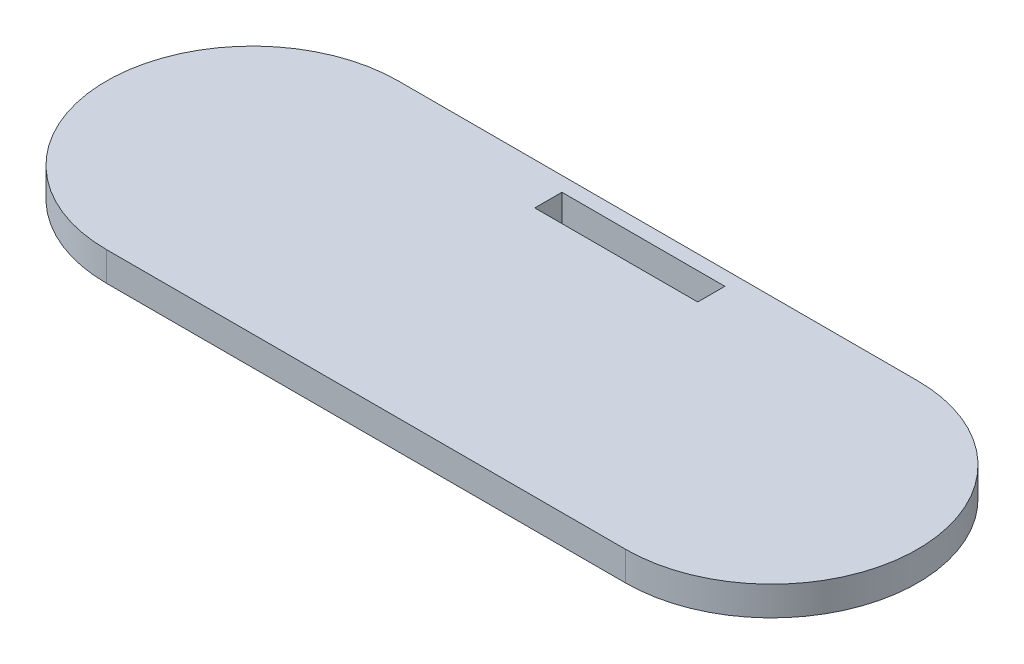
ISO-10303-21;
HEADER;
FILE_DESCRIPTION(('STEP AP214'),'2;1');
FILE_NAME('part.step','',(''),(''),'','','');
FILE_SCHEMA(('AUTOMOTIVE_DESIGN { 1 0 10303 214 1 1 1 1 }'));
ENDSEC;
DATA;
#1=APPLICATION_CONTEXT('core data for automotive mechanical design processes');
#2=APPLICATION_PROTOCOL_DEFINITION('international standard','automotive_design',2000,#1);
#3=PRODUCT_CONTEXT('',#1,'mechanical');
#4=PRODUCT('Part','Part','',(#3));
#5=PRODUCT_RELATED_PRODUCT_CATEGORY('part','',(#4));
#6=PRODUCT_DEFINITION_FORMATION('','',#4);
#7=PRODUCT_DEFINITION_CONTEXT('part definition',#1,'design');
#8=PRODUCT_DEFINITION('design','',#6,#7);
#9=PRODUCT_DEFINITION_SHAPE('','',#8);
#10=(LENGTH_UNIT() NAMED_UNIT(*) SI_UNIT(.MILLI.,.METRE.));
#11=(NAMED_UNIT(*) PLANE_ANGLE_UNIT() SI_UNIT($,.RADIAN.));
#12=(NAMED_UNIT(*) SI_UNIT($,.STERADIAN.) SOLID_ANGLE_UNIT());
#13=UNCERTAINTY_MEASURE_WITH_UNIT(LENGTH_MEASURE(1.E-05),#10,'distance_accuracy_value','');
#14=(GEOMETRIC_REPRESENTATION_CONTEXT(3) GLOBAL_UNCERTAINTY_ASSIGNED_CONTEXT((#13)) GLOBAL_UNIT_ASSIGNED_CONTEXT((#10,
#11,#12)) REPRESENTATION_CONTEXT('',''));
#15=CARTESIAN_POINT('',(0.,0.,0.));
#16=DIRECTION('',(0.,0.,1.));
#17=DIRECTION('',(1.,0.,0.));
#18=AXIS2_PLACEMENT_3D('',#15,#16,#17);
#19=CARTESIAN_POINT('',(0.,10.,0.));
#20=DIRECTION('',(0.,1.,0.));
#21=DIRECTION('',(0.,0.,1.));
#22=AXIS2_PLACEMENT_3D('',#19,#20,#21);
#23=PLANE('',#22);
#24=CARTESIAN_POINT('',(0.,10.,0.));
#25=DIRECTION('',(0.,1.,0.));
#26=DIRECTION('',(0.,0.,1.));
#27=AXIS2_PLACEMENT_3D('',#24,#25,#26);
#28=CIRCLE('',#27,50.);
#29=CARTESIAN_POINT('',(0.,10.,-50.));
#30=VERTEX_POINT('',#29);
#31=CARTESIAN_POINT('',(0.,10.,50.));
#32=VERTEX_POINT('',#31);
#33=EDGE_CURVE('E161',#30,#32,#28,.T.);
#34=ORIENTED_EDGE('',*,*,#33,.T.);
#35=DIRECTION('',(1.,0.,0.));
#36=VECTOR('',#35,1.);
#37=CARTESIAN_POINT('',(0.,10.,50.));
#38=LINE('',#37,#36);
#39=CARTESIAN_POINT('',(177.8,10.,50.));
#40=VERTEX_POINT('',#39);
#41=EDGE_CURVE('E165',#32,#40,#38,.T.);
#42=ORIENTED_EDGE('',*,*,#41,.T.);
#43=CARTESIAN_POINT('',(177.8,10.,0.));
#44=DIRECTION('',(0.,1.,0.));
#45=DIRECTION('',(0.,0.,1.));
#46=AXIS2_PLACEMENT_3D('',#43,#44,#45);
#47=CIRCLE('',#46,50.);
#48=CARTESIAN_POINT('',(177.8,10.,-50.));
#49=VERTEX_POINT('',#48);
#50=EDGE_CURVE('E169',#40,#49,#47,.T.);
#51=ORIENTED_EDGE('',*,*,#50,.T.);
#52=DIRECTION('',(-1.,0.,0.));
#53=VECTOR('',#52,1.);
#54=CARTESIAN_POINT('',(0.,10.,-50.));
#55=LINE('',#54,#53);
#56=EDGE_CURVE('E172',#49,#30,#55,.T.);
#57=ORIENTED_EDGE('',*,*,#56,.T.);
#58=EDGE_LOOP('',(#34,#42,#51,#57));
#59=FACE_BOUND('',#58,.T.);
#60=DIRECTION('',(1.,0.,0.));
#61=VECTOR('',#60,1.);
#62=CARTESIAN_POINT('',(61.,10.,-35.7));
#63=LINE('',#62,#61);
#64=CARTESIAN_POINT('',(61.,10.,-35.7));
#65=VERTEX_POINT('',#64);
#66=CARTESIAN_POINT('',(116.8,10.,-35.7));
#67=VERTEX_POINT('',#66);
#68=EDGE_CURVE('E120',#65,#67,#63,.T.);
#69=ORIENTED_EDGE('',*,*,#68,.F.);
#70=DIRECTION('',(0.,0.,1.));
#71=VECTOR('',#70,1.);
#72=CARTESIAN_POINT('',(61.,10.,-45.));
#73=LINE('',#72,#71);
#74=CARTESIAN_POINT('',(61.,10.,-45.));
#75=VERTEX_POINT('',#74);
#76=EDGE_CURVE('E111',#75,#65,#73,.T.);
#77=ORIENTED_EDGE('',*,*,#76,.F.);
#78=DIRECTION('',(-1.,0.,0.));
#79=VECTOR('',#78,1.);
#80=CARTESIAN_POINT('',(61.,10.,-45.));
#81=LINE('',#80,#79);
#82=CARTESIAN_POINT('',(116.8,10.,-45.));
#83=VERTEX_POINT('',#82);
#84=EDGE_CURVE('E139',#83,#75,#81,.T.);
#85=ORIENTED_EDGE('',*,*,#84,.F.);
#86=DIRECTION('',(0.,0.,-1.));
#87=VECTOR('',#86,1.);
#88=CARTESIAN_POINT('',(116.8,10.,-45.));
#89=LINE('',#88,#87);
#90=EDGE_CURVE('E133',#67,#83,#89,.T.);
#91=ORIENTED_EDGE('',*,*,#90,.F.);
#92=EDGE_LOOP('',(#69,#77,#85,#91));
#93=FACE_BOUND('',#92,.T.);
#94=ADVANCED_FACE('F45',(#59,#93),#23,.T.);
#95=CARTESIAN_POINT('',(0.,0.,0.));
#96=DIRECTION('',(0.,1.,0.));
#97=DIRECTION('',(0.,0.,1.));
#98=AXIS2_PLACEMENT_3D('',#95,#96,#97);
#99=PLANE('',#98);
#100=CARTESIAN_POINT('',(0.,0.,0.));
#101=DIRECTION('',(0.,1.,0.));
#102=DIRECTION('',(0.,0.,1.));
#103=AXIS2_PLACEMENT_3D('',#100,#101,#102);
#104=CIRCLE('',#103,50.);
#105=CARTESIAN_POINT('',(0.,0.,-50.));
#106=VERTEX_POINT('',#105);
#107=CARTESIAN_POINT('',(0.,0.,50.));
#108=VERTEX_POINT('',#107);
#109=EDGE_CURVE('E129',#106,#108,#104,.T.);
#110=ORIENTED_EDGE('',*,*,#109,.F.);
#111=DIRECTION('',(-1.,0.,0.));
#112=VECTOR('',#111,1.);
#113=CARTESIAN_POINT('',(0.,0.,-50.));
#114=LINE('',#113,#112);
#115=CARTESIAN_POINT('',(177.8,0.,-50.));
#116=VERTEX_POINT('',#115);
#117=EDGE_CURVE('E166',#116,#106,#114,.T.);
#118=ORIENTED_EDGE('',*,*,#117,.F.);
#119=CARTESIAN_POINT('',(177.8,0.,0.));
#120=DIRECTION('',(0.,1.,0.));
#121=DIRECTION('',(0.,0.,1.));
#122=AXIS2_PLACEMENT_3D('',#119,#120,#121);
#123=CIRCLE('',#122,50.);
#124=CARTESIAN_POINT('',(177.8,0.,50.));
#125=VERTEX_POINT('',#124);
#126=EDGE_CURVE('E182',#125,#116,#123,.T.);
#127=ORIENTED_EDGE('',*,*,#126,.F.);
#128=DIRECTION('',(1.,0.,0.));
#129=VECTOR('',#128,1.);
#130=CARTESIAN_POINT('',(0.,0.,50.));
#131=LINE('',#130,#129);
#132=EDGE_CURVE('E179',#108,#125,#131,.T.);
#133=ORIENTED_EDGE('',*,*,#132,.F.);
#134=EDGE_LOOP('',(#110,#118,#127,#133));
#135=FACE_BOUND('',#134,.T.);
#136=DIRECTION('',(0.,0.,1.));
#137=VECTOR('',#136,1.);
#138=CARTESIAN_POINT('',(61.,0.,-45.));
#139=LINE('',#138,#137);
#140=CARTESIAN_POINT('',(61.,0.,-45.));
#141=VERTEX_POINT('',#140);
#142=CARTESIAN_POINT('',(61.,0.,-35.7));
#143=VERTEX_POINT('',#142);
#144=EDGE_CURVE('E69',#141,#143,#139,.T.);
#145=ORIENTED_EDGE('',*,*,#144,.T.);
#146=DIRECTION('',(1.,0.,0.));
#147=VECTOR('',#146,1.);
#148=CARTESIAN_POINT('',(61.,0.,-35.7));
#149=LINE('',#148,#147);
#150=CARTESIAN_POINT('',(116.8,0.,-35.7));
#151=VERTEX_POINT('',#150);
#152=EDGE_CURVE('E127',#143,#151,#149,.T.);
#153=ORIENTED_EDGE('',*,*,#152,.T.);
#154=DIRECTION('',(0.,0.,-1.));
#155=VECTOR('',#154,1.);
#156=CARTESIAN_POINT('',(116.8,0.,-45.));
#157=LINE('',#156,#155);
#158=CARTESIAN_POINT('',(116.8,0.,-45.));
#159=VERTEX_POINT('',#158);
#160=EDGE_CURVE('E148',#151,#159,#157,.T.);
#161=ORIENTED_EDGE('',*,*,#160,.T.);
#162=DIRECTION('',(-1.,0.,0.));
#163=VECTOR('',#162,1.);
#164=CARTESIAN_POINT('',(61.,0.,-45.));
#165=LINE('',#164,#163);
#166=EDGE_CURVE('E121',#159,#141,#165,.T.);
#167=ORIENTED_EDGE('',*,*,#166,.T.);
#168=EDGE_LOOP('',(#145,#153,#161,#167));
#169=FACE_BOUND('',#168,.T.);
#170=ADVANCED_FACE('F207',(#135,#169),#99,.F.);
#171=CARTESIAN_POINT('',(0.,10.,0.));
#172=DIRECTION('',(0.,-1.,0.));
#173=DIRECTION('',(0.,0.,-1.));
#174=AXIS2_PLACEMENT_3D('',#171,#172,#173);
#175=CYLINDRICAL_SURFACE('',#174,50.);
#176=ORIENTED_EDGE('',*,*,#109,.T.);
#177=DIRECTION('',(0.,-1.,0.));
#178=VECTOR('',#177,1.);
#179=CARTESIAN_POINT('',(0.,10.,50.));
#180=LINE('',#179,#178);
#181=EDGE_CURVE('E11',#32,#108,#180,.T.);
#182=ORIENTED_EDGE('',*,*,#181,.F.);
#183=ORIENTED_EDGE('',*,*,#33,.F.);
#184=DIRECTION('',(0.,-1.,0.));
#185=VECTOR('',#184,1.);
#186=CARTESIAN_POINT('',(0.,10.,-50.));
#187=LINE('',#186,#185);
#188=EDGE_CURVE('E175',#30,#106,#187,.T.);
#189=ORIENTED_EDGE('',*,*,#188,.T.);
#190=EDGE_LOOP('',(#176,#182,#183,#189));
#191=FACE_BOUND('',#190,.T.);
#192=ADVANCED_FACE('F47',(#191),#175,.T.);
#193=CARTESIAN_POINT('',(0.,10.,50.));
#194=DIRECTION('',(0.,0.,-1.));
#195=DIRECTION('',(-1.,0.,0.));
#196=AXIS2_PLACEMENT_3D('',#193,#194,#195);
#197=PLANE('',#196);
#198=ORIENTED_EDGE('',*,*,#132,.T.);
#199=DIRECTION('',(0.,-1.,0.));
#200=VECTOR('',#199,1.);
#201=CARTESIAN_POINT('',(177.8,10.,50.));
#202=LINE('',#201,#200);
#203=EDGE_CURVE('E54',#40,#125,#202,.T.);
#204=ORIENTED_EDGE('',*,*,#203,.F.);
#205=ORIENTED_EDGE('',*,*,#41,.F.);
#206=ORIENTED_EDGE('',*,*,#181,.T.);
#207=EDGE_LOOP('',(#198,#204,#205,#206));
#208=FACE_BOUND('',#207,.T.);
#209=ADVANCED_FACE('F217',(#208),#197,.F.);
#210=CARTESIAN_POINT('',(177.8,10.,0.));
#211=DIRECTION('',(0.,-1.,0.));
#212=DIRECTION('',(0.,0.,-1.));
#213=AXIS2_PLACEMENT_3D('',#210,#211,#212);
#214=CYLINDRICAL_SURFACE('',#213,50.);
#215=ORIENTED_EDGE('',*,*,#126,.T.);
#216=DIRECTION('',(0.,-1.,0.));
#217=VECTOR('',#216,1.);
#218=CARTESIAN_POINT('',(177.8,10.,-50.));
#219=LINE('',#218,#217);
#220=EDGE_CURVE('E190',#49,#116,#219,.T.);
#221=ORIENTED_EDGE('',*,*,#220,.F.);
#222=ORIENTED_EDGE('',*,*,#50,.F.);
#223=ORIENTED_EDGE('',*,*,#203,.T.);
#224=EDGE_LOOP('',(#215,#221,#222,#223));
#225=FACE_BOUND('',#224,.T.);
#226=ADVANCED_FACE('F201',(#225),#214,.T.);
#227=CARTESIAN_POINT('',(0.,10.,-50.));
#228=DIRECTION('',(0.,0.,1.));
#229=DIRECTION('',(1.,0.,0.));
#230=AXIS2_PLACEMENT_3D('',#227,#228,#229);
#231=PLANE('',#230);
#232=ORIENTED_EDGE('',*,*,#117,.T.);
#233=ORIENTED_EDGE('',*,*,#188,.F.);
#234=ORIENTED_EDGE('',*,*,#56,.F.);
#235=ORIENTED_EDGE('',*,*,#220,.T.);
#236=EDGE_LOOP('',(#232,#233,#234,#235));
#237=FACE_BOUND('',#236,.T.);
#238=ADVANCED_FACE('F211',(#237),#231,.F.);
#239=CARTESIAN_POINT('',(61.,10.,-45.));
#240=DIRECTION('',(1.,0.,0.));
#241=DIRECTION('',(0.,0.,-1.));
#242=AXIS2_PLACEMENT_3D('',#239,#240,#241);
#243=PLANE('',#242);
#244=ORIENTED_EDGE('',*,*,#144,.F.);
#245=DIRECTION('',(0.,-1.,0.));
#246=VECTOR('',#245,1.);
#247=CARTESIAN_POINT('',(61.,10.,-45.));
#248=LINE('',#247,#246);
#249=EDGE_CURVE('E115',#75,#141,#248,.T.);
#250=ORIENTED_EDGE('',*,*,#249,.F.);
#251=ORIENTED_EDGE('',*,*,#76,.T.);
#252=DIRECTION('',(0.,-1.,0.));
#253=VECTOR('',#252,1.);
#254=CARTESIAN_POINT('',(61.,10.,-35.7));
#255=LINE('',#254,#253);
#256=EDGE_CURVE('E114',#65,#143,#255,.T.);
#257=ORIENTED_EDGE('',*,*,#256,.T.);
#258=EDGE_LOOP('',(#244,#250,#251,#257));
#259=FACE_BOUND('',#258,.T.);
#260=ADVANCED_FACE('F113',(#259),#243,.T.);
#261=CARTESIAN_POINT('',(61.,10.,-35.7));
#262=DIRECTION('',(0.,0.,-1.));
#263=DIRECTION('',(-1.,0.,0.));
#264=AXIS2_PLACEMENT_3D('',#261,#262,#263);
#265=PLANE('',#264);
#266=ORIENTED_EDGE('',*,*,#152,.F.);
#267=ORIENTED_EDGE('',*,*,#256,.F.);
#268=ORIENTED_EDGE('',*,*,#68,.T.);
#269=DIRECTION('',(0.,-1.,0.));
#270=VECTOR('',#269,1.);
#271=CARTESIAN_POINT('',(116.8,10.,-35.7));
#272=LINE('',#271,#270);
#273=EDGE_CURVE('E130',#67,#151,#272,.T.);
#274=ORIENTED_EDGE('',*,*,#273,.T.);
#275=EDGE_LOOP('',(#266,#267,#268,#274));
#276=FACE_BOUND('',#275,.T.);
#277=ADVANCED_FACE('F124',(#276),#265,.T.);
#278=CARTESIAN_POINT('',(116.8,10.,-45.));
#279=DIRECTION('',(-1.,0.,0.));
#280=DIRECTION('',(0.,0.,1.));
#281=AXIS2_PLACEMENT_3D('',#278,#279,#280);
#282=PLANE('',#281);
#283=ORIENTED_EDGE('',*,*,#160,.F.);
#284=ORIENTED_EDGE('',*,*,#273,.F.);
#285=ORIENTED_EDGE('',*,*,#90,.T.);
#286=DIRECTION('',(0.,-1.,0.));
#287=VECTOR('',#286,1.);
#288=CARTESIAN_POINT('',(116.8,10.,-45.));
#289=LINE('',#288,#287);
#290=EDGE_CURVE('E61',#83,#159,#289,.T.);
#291=ORIENTED_EDGE('',*,*,#290,.T.);
#292=EDGE_LOOP('',(#283,#284,#285,#291));
#293=FACE_BOUND('',#292,.T.);
#294=ADVANCED_FACE('F240',(#293),#282,.T.);
#295=CARTESIAN_POINT('',(61.,10.,-45.));
#296=DIRECTION('',(0.,0.,1.));
#297=DIRECTION('',(1.,0.,0.));
#298=AXIS2_PLACEMENT_3D('',#295,#296,#297);
#299=PLANE('',#298);
#300=ORIENTED_EDGE('',*,*,#166,.F.);
#301=ORIENTED_EDGE('',*,*,#290,.F.);
#302=ORIENTED_EDGE('',*,*,#84,.T.);
#303=ORIENTED_EDGE('',*,*,#249,.T.);
#304=EDGE_LOOP('',(#300,#301,#302,#303));
#305=FACE_BOUND('',#304,.T.);
#306=ADVANCED_FACE('F244',(#305),#299,.T.);
#307=CLOSED_SHELL('',(#94,#170,#192,#209,#226,#238,#260,#277,#294,#306));
#308=MANIFOLD_SOLID_BREP('B2',#307);
#309=ADVANCED_BREP_SHAPE_REPRESENTATION('',(#18,#308),#14);
#310=SHAPE_DEFINITION_REPRESENTATION(#9,#309);
ENDSEC;
END-ISO-10303-21;
